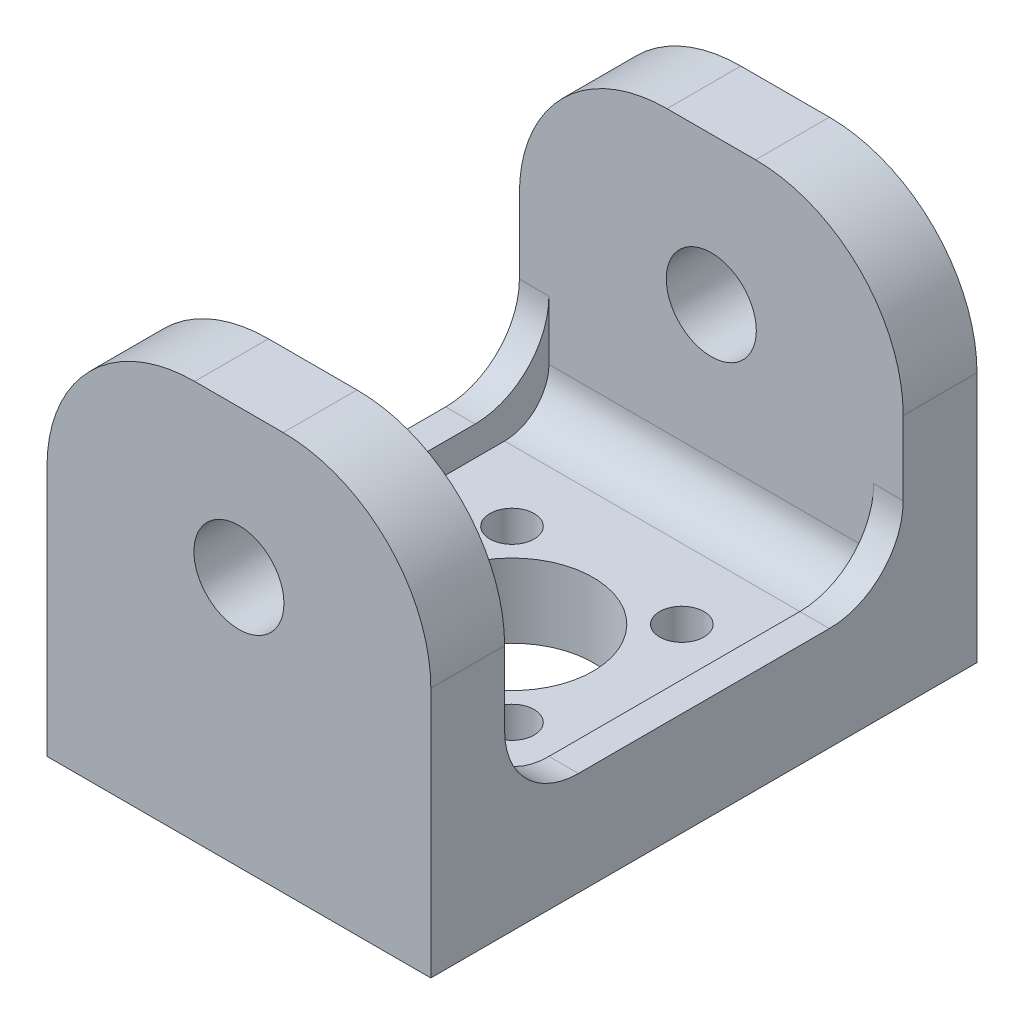
ISO-10303-21;
HEADER;
FILE_DESCRIPTION(('STEP AP214'),'2;1');
FILE_NAME('part.step','',(''),(''),'','','');
FILE_SCHEMA(('AUTOMOTIVE_DESIGN { 1 0 10303 214 1 1 1 1 }'));
ENDSEC;
DATA;
#1=APPLICATION_CONTEXT('core data for automotive mechanical design processes');
#2=APPLICATION_PROTOCOL_DEFINITION('international standard','automotive_design',2000,#1);
#3=PRODUCT_CONTEXT('',#1,'mechanical');
#4=PRODUCT('Part','Part','',(#3));
#5=PRODUCT_RELATED_PRODUCT_CATEGORY('part','',(#4));
#6=PRODUCT_DEFINITION_FORMATION('','',#4);
#7=PRODUCT_DEFINITION_CONTEXT('part definition',#1,'design');
#8=PRODUCT_DEFINITION('design','',#6,#7);
#9=PRODUCT_DEFINITION_SHAPE('','',#8);
#10=(LENGTH_UNIT() NAMED_UNIT(*) SI_UNIT(.MILLI.,.METRE.));
#11=(NAMED_UNIT(*) PLANE_ANGLE_UNIT() SI_UNIT($,.RADIAN.));
#12=(NAMED_UNIT(*) SI_UNIT($,.STERADIAN.) SOLID_ANGLE_UNIT());
#13=UNCERTAINTY_MEASURE_WITH_UNIT(LENGTH_MEASURE(1.E-05),#10,'distance_accuracy_value','');
#14=(GEOMETRIC_REPRESENTATION_CONTEXT(3) GLOBAL_UNCERTAINTY_ASSIGNED_CONTEXT((#13)) GLOBAL_UNIT_ASSIGNED_CONTEXT((#10,
#11,#12)) REPRESENTATION_CONTEXT('',''));
#15=CARTESIAN_POINT('',(0.,0.,0.));
#16=DIRECTION('',(0.,0.,1.));
#17=DIRECTION('',(1.,0.,0.));
#18=AXIS2_PLACEMENT_3D('',#15,#16,#17);
#19=CARTESIAN_POINT('',(0.,5.,0.));
#20=DIRECTION('',(0.,1.,0.));
#21=DIRECTION('',(0.,0.,1.));
#22=AXIS2_PLACEMENT_3D('',#19,#20,#21);
#23=PLANE('',#22);
#24=CARTESIAN_POINT('',(5.75,5.,-5.75000000000033));
#25=DIRECTION('',(0.,1.,0.));
#26=DIRECTION('',(0.,0.,1.));
#27=AXIS2_PLACEMENT_3D('',#24,#25,#26);
#28=CIRCLE('',#27,1.5);
#29=CARTESIAN_POINT('',(5.75,5.,-4.25000000000033));
#30=VERTEX_POINT('',#29);
#31=EDGE_CURVE('E303',#30,#30,#28,.T.);
#32=ORIENTED_EDGE('',*,*,#31,.F.);
#33=EDGE_LOOP('',(#32));
#34=FACE_BOUND('',#33,.T.);
#35=CARTESIAN_POINT('',(0.,5.,0.));
#36=DIRECTION('',(0.,1.,0.));
#37=DIRECTION('',(0.,0.,1.));
#38=AXIS2_PLACEMENT_3D('',#35,#36,#37);
#39=CIRCLE('',#38,5.5);
#40=CARTESIAN_POINT('',(0.,5.,5.5));
#41=VERTEX_POINT('',#40);
#42=EDGE_CURVE('E312',#41,#41,#39,.T.);
#43=ORIENTED_EDGE('',*,*,#42,.F.);
#44=EDGE_LOOP('',(#43));
#45=FACE_BOUND('',#44,.T.);
#46=CARTESIAN_POINT('',(5.75000000000032,5.,5.74999999999967));
#47=DIRECTION('',(0.,1.,0.));
#48=DIRECTION('',(0.,0.,1.));
#49=AXIS2_PLACEMENT_3D('',#46,#47,#48);
#50=CIRCLE('',#49,1.5);
#51=CARTESIAN_POINT('',(5.75000000000032,5.,7.24999999999967));
#52=VERTEX_POINT('',#51);
#53=EDGE_CURVE('E304',#52,#52,#50,.T.);
#54=ORIENTED_EDGE('',*,*,#53,.F.);
#55=EDGE_LOOP('',(#54));
#56=FACE_BOUND('',#55,.T.);
#57=CARTESIAN_POINT('',(-5.74999999999967,5.,5.75));
#58=DIRECTION('',(0.,1.,0.));
#59=DIRECTION('',(0.,0.,1.));
#60=AXIS2_PLACEMENT_3D('',#57,#58,#59);
#61=CIRCLE('',#60,1.5);
#62=CARTESIAN_POINT('',(-5.74999999999967,5.,7.25));
#63=VERTEX_POINT('',#62);
#64=EDGE_CURVE('E289',#63,#63,#61,.T.);
#65=ORIENTED_EDGE('',*,*,#64,.F.);
#66=EDGE_LOOP('',(#65));
#67=FACE_BOUND('',#66,.T.);
#68=CARTESIAN_POINT('',(-5.75,5.,-5.75));
#69=DIRECTION('',(0.,1.,0.));
#70=DIRECTION('',(0.,0.,1.));
#71=AXIS2_PLACEMENT_3D('',#68,#69,#70);
#72=CIRCLE('',#71,1.5);
#73=CARTESIAN_POINT('',(-5.75,5.,-4.25));
#74=VERTEX_POINT('',#73);
#75=EDGE_CURVE('E321',#74,#74,#72,.T.);
#76=ORIENTED_EDGE('',*,*,#75,.F.);
#77=EDGE_LOOP('',(#76));
#78=FACE_BOUND('',#77,.T.);
#79=DIRECTION('',(1.,0.,0.));
#80=VECTOR('',#79,1.);
#81=CARTESIAN_POINT('',(0.,5.,10.5));
#82=LINE('',#81,#80);
#83=CARTESIAN_POINT('',(-11.,5.,10.5));
#84=VERTEX_POINT('',#83);
#85=CARTESIAN_POINT('',(11.,5.,10.5));
#86=VERTEX_POINT('',#85);
#87=EDGE_CURVE('E199',#84,#86,#82,.T.);
#88=ORIENTED_EDGE('',*,*,#87,.T.);
#89=DIRECTION('',(0.,0.,-1.));
#90=VECTOR('',#89,1.);
#91=CARTESIAN_POINT('',(11.,5.,0.));
#92=LINE('',#91,#90);
#93=CARTESIAN_POINT('',(11.,5.,-10.5));
#94=VERTEX_POINT('',#93);
#95=EDGE_CURVE('E187',#86,#94,#92,.T.);
#96=ORIENTED_EDGE('',*,*,#95,.T.);
#97=DIRECTION('',(-1.,0.,0.));
#98=VECTOR('',#97,1.);
#99=CARTESIAN_POINT('',(0.,5.,-10.5));
#100=LINE('',#99,#98);
#101=CARTESIAN_POINT('',(-11.,5.,-10.5));
#102=VERTEX_POINT('',#101);
#103=EDGE_CURVE('E197',#94,#102,#100,.T.);
#104=ORIENTED_EDGE('',*,*,#103,.T.);
#105=DIRECTION('',(0.,0.,1.));
#106=VECTOR('',#105,1.);
#107=CARTESIAN_POINT('',(-11.,5.,0.));
#108=LINE('',#107,#106);
#109=EDGE_CURVE('E274',#102,#84,#108,.T.);
#110=ORIENTED_EDGE('',*,*,#109,.T.);
#111=EDGE_LOOP('',(#88,#96,#104,#110));
#112=FACE_BOUND('',#111,.T.);
#113=ADVANCED_FACE('F37',(#34,#45,#56,#67,#78,#112),#23,.T.);
#114=CARTESIAN_POINT('',(0.,8.,10.5));
#115=DIRECTION('',(1.,0.,0.));
#116=DIRECTION('',(0.,0.,-1.));
#117=AXIS2_PLACEMENT_3D('',#114,#115,#116);
#118=CYLINDRICAL_SURFACE('',#117,3.);
#119=DIRECTION('',(1.,0.,0.));
#120=VECTOR('',#119,1.);
#121=CARTESIAN_POINT('',(-13.,8.,13.5));
#122=LINE('',#121,#120);
#123=CARTESIAN_POINT('',(11.,8.,13.5));
#124=VERTEX_POINT('',#123);
#125=CARTESIAN_POINT('',(-11.,8.,13.5));
#126=VERTEX_POINT('',#125);
#127=EDGE_CURVE('E207',#124,#126,#122,.F.);
#128=ORIENTED_EDGE('',*,*,#127,.F.);
#129=CARTESIAN_POINT('',(11.,8.,10.5));
#130=DIRECTION('',(1.,0.,0.));
#131=DIRECTION('',(0.,0.,-1.));
#132=AXIS2_PLACEMENT_3D('',#129,#130,#131);
#133=CIRCLE('',#132,3.);
#134=EDGE_CURVE('E200',#86,#124,#133,.F.);
#135=ORIENTED_EDGE('',*,*,#134,.F.);
#136=ORIENTED_EDGE('',*,*,#87,.F.);
#137=CARTESIAN_POINT('',(-11.,8.,10.5));
#138=DIRECTION('',(-1.,0.,0.));
#139=DIRECTION('',(0.,0.,1.));
#140=AXIS2_PLACEMENT_3D('',#137,#138,#139);
#141=CIRCLE('',#140,3.);
#142=EDGE_CURVE('E52',#126,#84,#141,.F.);
#143=ORIENTED_EDGE('',*,*,#142,.F.);
#144=EDGE_LOOP('',(#128,#135,#136,#143));
#145=FACE_BOUND('',#144,.T.);
#146=ADVANCED_FACE('F487',(#145),#118,.F.);
#147=CARTESIAN_POINT('',(0.,8.,-10.5));
#148=DIRECTION('',(-1.,0.,0.));
#149=DIRECTION('',(0.,0.,1.));
#150=AXIS2_PLACEMENT_3D('',#147,#148,#149);
#151=CYLINDRICAL_SURFACE('',#150,3.);
#152=CARTESIAN_POINT('',(11.,8.,-10.5));
#153=DIRECTION('',(1.,0.,0.));
#154=DIRECTION('',(0.,0.,-1.));
#155=AXIS2_PLACEMENT_3D('',#152,#153,#154);
#156=CIRCLE('',#155,3.);
#157=CARTESIAN_POINT('',(11.,8.,-13.5));
#158=VERTEX_POINT('',#157);
#159=EDGE_CURVE('E60',#158,#94,#156,.F.);
#160=ORIENTED_EDGE('',*,*,#159,.F.);
#161=DIRECTION('',(-1.,0.,0.));
#162=VECTOR('',#161,1.);
#163=CARTESIAN_POINT('',(-13.,8.,-13.5));
#164=LINE('',#163,#162);
#165=CARTESIAN_POINT('',(-11.,8.,-13.5));
#166=VERTEX_POINT('',#165);
#167=EDGE_CURVE('E215',#166,#158,#164,.F.);
#168=ORIENTED_EDGE('',*,*,#167,.F.);
#169=CARTESIAN_POINT('',(-11.,8.,-10.5));
#170=DIRECTION('',(-1.,0.,0.));
#171=DIRECTION('',(0.,0.,1.));
#172=AXIS2_PLACEMENT_3D('',#169,#170,#171);
#173=CIRCLE('',#172,3.);
#174=EDGE_CURVE('E204',#102,#166,#173,.F.);
#175=ORIENTED_EDGE('',*,*,#174,.F.);
#176=ORIENTED_EDGE('',*,*,#103,.F.);
#177=EDGE_LOOP('',(#160,#168,#175,#176));
#178=FACE_BOUND('',#177,.T.);
#179=ADVANCED_FACE('F203',(#178),#151,.F.);
#180=CARTESIAN_POINT('',(13.,5.,-18.5));
#181=DIRECTION('',(-1.,0.,0.));
#182=DIRECTION('',(0.,0.,1.));
#183=AXIS2_PLACEMENT_3D('',#180,#181,#182);
#184=PLANE('',#183);
#185=DIRECTION('',(0.,0.,-1.));
#186=VECTOR('',#185,1.);
#187=CARTESIAN_POINT('',(13.,7.,-18.5));
#188=LINE('',#187,#186);
#189=CARTESIAN_POINT('',(13.,7.,8.5));
#190=VERTEX_POINT('',#189);
#191=CARTESIAN_POINT('',(13.,7.,-8.5));
#192=VERTEX_POINT('',#191);
#193=EDGE_CURVE('E430',#190,#192,#188,.T.);
#194=ORIENTED_EDGE('',*,*,#193,.F.);
#195=CARTESIAN_POINT('',(13.,12.,8.5));
#196=DIRECTION('',(-1.,0.,0.));
#197=DIRECTION('',(0.,0.,1.));
#198=AXIS2_PLACEMENT_3D('',#195,#196,#197);
#199=CIRCLE('',#198,5.);
#200=CARTESIAN_POINT('',(13.,12.,13.5));
#201=VERTEX_POINT('',#200);
#202=EDGE_CURVE('E254',#190,#201,#199,.T.);
#203=ORIENTED_EDGE('',*,*,#202,.T.);
#204=DIRECTION('',(0.,-1.,0.));
#205=VECTOR('',#204,1.);
#206=CARTESIAN_POINT('',(13.,27.,13.5));
#207=LINE('',#206,#205);
#208=CARTESIAN_POINT('',(13.,17.,13.5));
#209=VERTEX_POINT('',#208);
#210=EDGE_CURVE('E414',#209,#201,#207,.T.);
#211=ORIENTED_EDGE('',*,*,#210,.F.);
#212=DIRECTION('',(0.,0.,-1.));
#213=VECTOR('',#212,1.);
#214=CARTESIAN_POINT('',(13.,17.,18.5));
#215=LINE('',#214,#213);
#216=CARTESIAN_POINT('',(13.,17.,18.5));
#217=VERTEX_POINT('',#216);
#218=EDGE_CURVE('E205',#209,#217,#215,.F.);
#219=ORIENTED_EDGE('',*,*,#218,.T.);
#220=DIRECTION('',(0.,-1.,0.));
#221=VECTOR('',#220,1.);
#222=CARTESIAN_POINT('',(13.,5.,18.5));
#223=LINE('',#222,#221);
#224=CARTESIAN_POINT('',(13.,0.,18.5));
#225=VERTEX_POINT('',#224);
#226=EDGE_CURVE('E337',#217,#225,#223,.T.);
#227=ORIENTED_EDGE('',*,*,#226,.T.);
#228=DIRECTION('',(0.,0.,-1.));
#229=VECTOR('',#228,1.);
#230=CARTESIAN_POINT('',(13.,0.,-18.5));
#231=LINE('',#230,#229);
#232=CARTESIAN_POINT('',(13.,0.,-18.5));
#233=VERTEX_POINT('',#232);
#234=EDGE_CURVE('E324',#225,#233,#231,.T.);
#235=ORIENTED_EDGE('',*,*,#234,.T.);
#236=DIRECTION('',(0.,-1.,0.));
#237=VECTOR('',#236,1.);
#238=CARTESIAN_POINT('',(13.,5.,-18.5));
#239=LINE('',#238,#237);
#240=CARTESIAN_POINT('',(13.,17.,-18.5));
#241=VERTEX_POINT('',#240);
#242=EDGE_CURVE('E344',#241,#233,#239,.T.);
#243=ORIENTED_EDGE('',*,*,#242,.F.);
#244=DIRECTION('',(0.,0.,-1.));
#245=VECTOR('',#244,1.);
#246=CARTESIAN_POINT('',(13.,17.,-13.5));
#247=LINE('',#246,#245);
#248=CARTESIAN_POINT('',(13.,17.,-13.5));
#249=VERTEX_POINT('',#248);
#250=EDGE_CURVE('E209',#241,#249,#247,.F.);
#251=ORIENTED_EDGE('',*,*,#250,.T.);
#252=DIRECTION('',(0.,-1.,0.));
#253=VECTOR('',#252,1.);
#254=CARTESIAN_POINT('',(13.,27.,-13.5));
#255=LINE('',#254,#253);
#256=CARTESIAN_POINT('',(13.,12.,-13.5));
#257=VERTEX_POINT('',#256);
#258=EDGE_CURVE('E290',#249,#257,#255,.T.);
#259=ORIENTED_EDGE('',*,*,#258,.T.);
#260=CARTESIAN_POINT('',(13.,12.,-8.5));
#261=DIRECTION('',(-1.,0.,0.));
#262=DIRECTION('',(0.,0.,1.));
#263=AXIS2_PLACEMENT_3D('',#260,#261,#262);
#264=CIRCLE('',#263,5.);
#265=EDGE_CURVE('E248',#257,#192,#264,.T.);
#266=ORIENTED_EDGE('',*,*,#265,.T.);
#267=EDGE_LOOP('',(#194,#203,#211,#219,#227,#235,#243,#251,#259,#266));
#268=FACE_BOUND('',#267,.T.);
#269=ADVANCED_FACE('F386',(#268),#184,.F.);
#270=CARTESIAN_POINT('',(-13.,5.,-18.5));
#271=DIRECTION('',(0.,0.,1.));
#272=DIRECTION('',(1.,0.,0.));
#273=AXIS2_PLACEMENT_3D('',#270,#271,#272);
#274=PLANE('',#273);
#275=DIRECTION('',(-1.,0.,0.));
#276=VECTOR('',#275,1.);
#277=CARTESIAN_POINT('',(-13.,0.,-18.5));
#278=LINE('',#277,#276);
#279=CARTESIAN_POINT('',(-13.,0.,-18.5));
#280=VERTEX_POINT('',#279);
#281=EDGE_CURVE('E329',#233,#280,#278,.T.);
#282=ORIENTED_EDGE('',*,*,#281,.T.);
#283=DIRECTION('',(0.,-1.,0.));
#284=VECTOR('',#283,1.);
#285=CARTESIAN_POINT('',(-13.,5.,-18.5));
#286=LINE('',#285,#284);
#287=CARTESIAN_POINT('',(-13.,17.,-18.5));
#288=VERTEX_POINT('',#287);
#289=EDGE_CURVE('E341',#288,#280,#286,.T.);
#290=ORIENTED_EDGE('',*,*,#289,.F.);
#291=CARTESIAN_POINT('',(-3.,17.,-18.5));
#292=DIRECTION('',(0.,0.,1.));
#293=DIRECTION('',(1.,0.,0.));
#294=AXIS2_PLACEMENT_3D('',#291,#292,#293);
#295=CIRCLE('',#294,10.);
#296=CARTESIAN_POINT('',(-3.,27.,-18.5));
#297=VERTEX_POINT('',#296);
#298=EDGE_CURVE('E366',#288,#297,#295,.F.);
#299=ORIENTED_EDGE('',*,*,#298,.T.);
#300=DIRECTION('',(-1.,0.,0.));
#301=VECTOR('',#300,1.);
#302=CARTESIAN_POINT('',(-13.,27.,-18.5));
#303=LINE('',#302,#301);
#304=CARTESIAN_POINT('',(3.,27.,-18.5));
#305=VERTEX_POINT('',#304);
#306=EDGE_CURVE('E296',#305,#297,#303,.T.);
#307=ORIENTED_EDGE('',*,*,#306,.F.);
#308=CARTESIAN_POINT('',(3.,17.,-18.5));
#309=DIRECTION('',(0.,0.,1.));
#310=DIRECTION('',(1.,0.,0.));
#311=AXIS2_PLACEMENT_3D('',#308,#309,#310);
#312=CIRCLE('',#311,10.);
#313=EDGE_CURVE('E364',#305,#241,#312,.F.);
#314=ORIENTED_EDGE('',*,*,#313,.T.);
#315=ORIENTED_EDGE('',*,*,#242,.T.);
#316=EDGE_LOOP('',(#282,#290,#299,#307,#314,#315));
#317=FACE_BOUND('',#316,.T.);
#318=CARTESIAN_POINT('',(0.,17.,-18.5));
#319=DIRECTION('',(0.,0.,1.));
#320=DIRECTION('',(1.,0.,0.));
#321=AXIS2_PLACEMENT_3D('',#318,#319,#320);
#322=CIRCLE('',#321,3.05);
#323=CARTESIAN_POINT('',(3.05,17.,-18.5));
#324=VERTEX_POINT('',#323);
#325=EDGE_CURVE('E351',#324,#324,#322,.T.);
#326=ORIENTED_EDGE('',*,*,#325,.T.);
#327=EDGE_LOOP('',(#326));
#328=FACE_BOUND('',#327,.T.);
#329=ADVANCED_FACE('F400',(#317,#328),#274,.F.);
#330=CARTESIAN_POINT('',(-13.,5.,-18.5));
#331=DIRECTION('',(1.,0.,0.));
#332=DIRECTION('',(0.,0.,-1.));
#333=AXIS2_PLACEMENT_3D('',#330,#331,#332);
#334=PLANE('',#333);
#335=DIRECTION('',(0.,-1.,0.));
#336=VECTOR('',#335,1.);
#337=CARTESIAN_POINT('',(-13.,27.,13.5));
#338=LINE('',#337,#336);
#339=CARTESIAN_POINT('',(-13.,17.,13.5));
#340=VERTEX_POINT('',#339);
#341=CARTESIAN_POINT('',(-13.,12.,13.5));
#342=VERTEX_POINT('',#341);
#343=EDGE_CURVE('E412',#340,#342,#338,.T.);
#344=ORIENTED_EDGE('',*,*,#343,.T.);
#345=CARTESIAN_POINT('',(-13.,12.,8.5));
#346=DIRECTION('',(1.,0.,0.));
#347=DIRECTION('',(0.,0.,-1.));
#348=AXIS2_PLACEMENT_3D('',#345,#346,#347);
#349=CIRCLE('',#348,5.);
#350=CARTESIAN_POINT('',(-13.,7.,8.5));
#351=VERTEX_POINT('',#350);
#352=EDGE_CURVE('E256',#342,#351,#349,.T.);
#353=ORIENTED_EDGE('',*,*,#352,.T.);
#354=DIRECTION('',(0.,0.,1.));
#355=VECTOR('',#354,1.);
#356=CARTESIAN_POINT('',(-13.,7.,-18.5));
#357=LINE('',#356,#355);
#358=CARTESIAN_POINT('',(-13.,7.,-8.5));
#359=VERTEX_POINT('',#358);
#360=EDGE_CURVE('E275',#359,#351,#357,.T.);
#361=ORIENTED_EDGE('',*,*,#360,.F.);
#362=CARTESIAN_POINT('',(-13.,12.,-8.5));
#363=DIRECTION('',(1.,0.,0.));
#364=DIRECTION('',(0.,0.,-1.));
#365=AXIS2_PLACEMENT_3D('',#362,#363,#364);
#366=CIRCLE('',#365,5.);
#367=CARTESIAN_POINT('',(-13.,12.,-13.5));
#368=VERTEX_POINT('',#367);
#369=EDGE_CURVE('E11',#359,#368,#366,.T.);
#370=ORIENTED_EDGE('',*,*,#369,.T.);
#371=DIRECTION('',(0.,-1.,0.));
#372=VECTOR('',#371,1.);
#373=CARTESIAN_POINT('',(-13.,27.,-13.5));
#374=LINE('',#373,#372);
#375=CARTESIAN_POINT('',(-13.,17.,-13.5));
#376=VERTEX_POINT('',#375);
#377=EDGE_CURVE('E283',#376,#368,#374,.T.);
#378=ORIENTED_EDGE('',*,*,#377,.F.);
#379=DIRECTION('',(0.,0.,1.));
#380=VECTOR('',#379,1.);
#381=CARTESIAN_POINT('',(-13.,17.,-18.5));
#382=LINE('',#381,#380);
#383=EDGE_CURVE('E362',#376,#288,#382,.F.);
#384=ORIENTED_EDGE('',*,*,#383,.T.);
#385=ORIENTED_EDGE('',*,*,#289,.T.);
#386=DIRECTION('',(0.,0.,1.));
#387=VECTOR('',#386,1.);
#388=CARTESIAN_POINT('',(-13.,0.,-18.5));
#389=LINE('',#388,#387);
#390=CARTESIAN_POINT('',(-13.,0.,18.5));
#391=VERTEX_POINT('',#390);
#392=EDGE_CURVE('E331',#280,#391,#389,.T.);
#393=ORIENTED_EDGE('',*,*,#392,.T.);
#394=DIRECTION('',(0.,-1.,0.));
#395=VECTOR('',#394,1.);
#396=CARTESIAN_POINT('',(-13.,5.,18.5));
#397=LINE('',#396,#395);
#398=CARTESIAN_POINT('',(-13.,17.,18.5));
#399=VERTEX_POINT('',#398);
#400=EDGE_CURVE('E339',#399,#391,#397,.T.);
#401=ORIENTED_EDGE('',*,*,#400,.F.);
#402=DIRECTION('',(0.,0.,1.));
#403=VECTOR('',#402,1.);
#404=CARTESIAN_POINT('',(-13.,17.,13.5));
#405=LINE('',#404,#403);
#406=EDGE_CURVE('E360',#399,#340,#405,.F.);
#407=ORIENTED_EDGE('',*,*,#406,.T.);
#408=EDGE_LOOP('',(#344,#353,#361,#370,#378,#384,#385,#393,#401,#407));
#409=FACE_BOUND('',#408,.T.);
#410=ADVANCED_FACE('F282',(#409),#334,.F.);
#411=CARTESIAN_POINT('',(-13.,5.,18.5));
#412=DIRECTION('',(0.,0.,-1.));
#413=DIRECTION('',(-1.,0.,0.));
#414=AXIS2_PLACEMENT_3D('',#411,#412,#413);
#415=PLANE('',#414);
#416=DIRECTION('',(1.,0.,0.));
#417=VECTOR('',#416,1.);
#418=CARTESIAN_POINT('',(-13.,0.,18.5));
#419=LINE('',#418,#417);
#420=EDGE_CURVE('E334',#391,#225,#419,.T.);
#421=ORIENTED_EDGE('',*,*,#420,.T.);
#422=ORIENTED_EDGE('',*,*,#226,.F.);
#423=CARTESIAN_POINT('',(3.,17.,18.5));
#424=DIRECTION('',(0.,0.,-1.));
#425=DIRECTION('',(-1.,0.,0.));
#426=AXIS2_PLACEMENT_3D('',#423,#424,#425);
#427=CIRCLE('',#426,10.);
#428=CARTESIAN_POINT('',(3.,27.,18.5));
#429=VERTEX_POINT('',#428);
#430=EDGE_CURVE('E374',#217,#429,#427,.F.);
#431=ORIENTED_EDGE('',*,*,#430,.T.);
#432=DIRECTION('',(1.,0.,0.));
#433=VECTOR('',#432,1.);
#434=CARTESIAN_POINT('',(-13.,27.,18.5));
#435=LINE('',#434,#433);
#436=CARTESIAN_POINT('',(-3.,27.,18.5));
#437=VERTEX_POINT('',#436);
#438=EDGE_CURVE('E404',#437,#429,#435,.T.);
#439=ORIENTED_EDGE('',*,*,#438,.F.);
#440=CARTESIAN_POINT('',(-3.,17.,18.5));
#441=DIRECTION('',(0.,0.,-1.));
#442=DIRECTION('',(-1.,0.,0.));
#443=AXIS2_PLACEMENT_3D('',#440,#441,#442);
#444=CIRCLE('',#443,10.);
#445=EDGE_CURVE('E376',#437,#399,#444,.F.);
#446=ORIENTED_EDGE('',*,*,#445,.T.);
#447=ORIENTED_EDGE('',*,*,#400,.T.);
#448=EDGE_LOOP('',(#421,#422,#431,#439,#446,#447));
#449=FACE_BOUND('',#448,.T.);
#450=CARTESIAN_POINT('',(0.,17.,18.5));
#451=DIRECTION('',(0.,0.,1.));
#452=DIRECTION('',(1.,0.,0.));
#453=AXIS2_PLACEMENT_3D('',#450,#451,#452);
#454=CIRCLE('',#453,3.05);
#455=CARTESIAN_POINT('',(3.05,17.,18.5));
#456=VERTEX_POINT('',#455);
#457=EDGE_CURVE('E421',#456,#456,#454,.T.);
#458=ORIENTED_EDGE('',*,*,#457,.F.);
#459=EDGE_LOOP('',(#458));
#460=FACE_BOUND('',#459,.T.);
#461=ADVANCED_FACE('F459',(#449,#460),#415,.F.);
#462=CARTESIAN_POINT('',(0.,0.,0.));
#463=DIRECTION('',(0.,1.,0.));
#464=DIRECTION('',(0.,0.,1.));
#465=AXIS2_PLACEMENT_3D('',#462,#463,#464);
#466=PLANE('',#465);
#467=ORIENTED_EDGE('',*,*,#234,.F.);
#468=ORIENTED_EDGE('',*,*,#420,.F.);
#469=ORIENTED_EDGE('',*,*,#392,.F.);
#470=ORIENTED_EDGE('',*,*,#281,.F.);
#471=EDGE_LOOP('',(#467,#468,#469,#470));
#472=FACE_BOUND('',#471,.T.);
#473=CARTESIAN_POINT('',(5.75,0.,-5.75000000000033));
#474=DIRECTION('',(0.,1.,0.));
#475=DIRECTION('',(0.,0.,1.));
#476=AXIS2_PLACEMENT_3D('',#473,#474,#475);
#477=CIRCLE('',#476,1.5);
#478=CARTESIAN_POINT('',(5.75,0.,-4.25000000000033));
#479=VERTEX_POINT('',#478);
#480=EDGE_CURVE('E309',#479,#479,#477,.T.);
#481=ORIENTED_EDGE('',*,*,#480,.T.);
#482=EDGE_LOOP('',(#481));
#483=FACE_BOUND('',#482,.T.);
#484=CARTESIAN_POINT('',(0.,0.,0.));
#485=DIRECTION('',(0.,1.,0.));
#486=DIRECTION('',(0.,0.,1.));
#487=AXIS2_PLACEMENT_3D('',#484,#485,#486);
#488=CIRCLE('',#487,5.5);
#489=CARTESIAN_POINT('',(0.,0.,5.5));
#490=VERTEX_POINT('',#489);
#491=EDGE_CURVE('E315',#490,#490,#488,.T.);
#492=ORIENTED_EDGE('',*,*,#491,.T.);
#493=EDGE_LOOP('',(#492));
#494=FACE_BOUND('',#493,.T.);
#495=CARTESIAN_POINT('',(5.75000000000032,0.,5.74999999999967));
#496=DIRECTION('',(0.,1.,0.));
#497=DIRECTION('',(0.,0.,1.));
#498=AXIS2_PLACEMENT_3D('',#495,#496,#497);
#499=CIRCLE('',#498,1.5);
#500=CARTESIAN_POINT('',(5.75000000000032,0.,7.24999999999967));
#501=VERTEX_POINT('',#500);
#502=EDGE_CURVE('E300',#501,#501,#499,.T.);
#503=ORIENTED_EDGE('',*,*,#502,.T.);
#504=EDGE_LOOP('',(#503));
#505=FACE_BOUND('',#504,.T.);
#506=CARTESIAN_POINT('',(-5.74999999999967,0.,5.75));
#507=DIRECTION('',(0.,1.,0.));
#508=DIRECTION('',(0.,0.,1.));
#509=AXIS2_PLACEMENT_3D('',#506,#507,#508);
#510=CIRCLE('',#509,1.5);
#511=CARTESIAN_POINT('',(-5.74999999999967,0.,7.25));
#512=VERTEX_POINT('',#511);
#513=EDGE_CURVE('E293',#512,#512,#510,.T.);
#514=ORIENTED_EDGE('',*,*,#513,.T.);
#515=EDGE_LOOP('',(#514));
#516=FACE_BOUND('',#515,.T.);
#517=CARTESIAN_POINT('',(-5.75,0.,-5.75));
#518=DIRECTION('',(0.,1.,0.));
#519=DIRECTION('',(0.,0.,1.));
#520=AXIS2_PLACEMENT_3D('',#517,#518,#519);
#521=CIRCLE('',#520,1.5);
#522=CARTESIAN_POINT('',(-5.75,0.,-4.25));
#523=VERTEX_POINT('',#522);
#524=EDGE_CURVE('E318',#523,#523,#521,.T.);
#525=ORIENTED_EDGE('',*,*,#524,.T.);
#526=EDGE_LOOP('',(#525));
#527=FACE_BOUND('',#526,.T.);
#528=ADVANCED_FACE('F468',(#472,#483,#494,#505,#516,#527),#466,.F.);
#529=CARTESIAN_POINT('',(-5.75,5.,-5.75));
#530=DIRECTION('',(0.,-1.,0.));
#531=DIRECTION('',(0.,0.,-1.));
#532=AXIS2_PLACEMENT_3D('',#529,#530,#531);
#533=CYLINDRICAL_SURFACE('',#532,1.5);
#534=ORIENTED_EDGE('',*,*,#75,.T.);
#535=EDGE_LOOP('',(#534));
#536=FACE_BOUND('',#535,.T.);
#537=ORIENTED_EDGE('',*,*,#524,.F.);
#538=EDGE_LOOP('',(#537));
#539=FACE_BOUND('',#538,.T.);
#540=ADVANCED_FACE('F498',(#536,#539),#533,.F.);
#541=CARTESIAN_POINT('',(-5.74999999999967,5.,5.75));
#542=DIRECTION('',(0.,-1.,0.));
#543=DIRECTION('',(0.,0.,-1.));
#544=AXIS2_PLACEMENT_3D('',#541,#542,#543);
#545=CYLINDRICAL_SURFACE('',#544,1.5);
#546=ORIENTED_EDGE('',*,*,#64,.T.);
#547=EDGE_LOOP('',(#546));
#548=FACE_BOUND('',#547,.T.);
#549=ORIENTED_EDGE('',*,*,#513,.F.);
#550=EDGE_LOOP('',(#549));
#551=FACE_BOUND('',#550,.T.);
#552=ADVANCED_FACE('F755',(#548,#551),#545,.F.);
#553=CARTESIAN_POINT('',(5.75000000000032,5.,5.74999999999967));
#554=DIRECTION('',(0.,-1.,0.));
#555=DIRECTION('',(0.,0.,-1.));
#556=AXIS2_PLACEMENT_3D('',#553,#554,#555);
#557=CYLINDRICAL_SURFACE('',#556,1.5);
#558=ORIENTED_EDGE('',*,*,#53,.T.);
#559=EDGE_LOOP('',(#558));
#560=FACE_BOUND('',#559,.T.);
#561=ORIENTED_EDGE('',*,*,#502,.F.);
#562=EDGE_LOOP('',(#561));
#563=FACE_BOUND('',#562,.T.);
#564=ADVANCED_FACE('F745',(#560,#563),#557,.F.);
#565=CARTESIAN_POINT('',(0.,5.,0.));
#566=DIRECTION('',(0.,-1.,0.));
#567=DIRECTION('',(0.,0.,-1.));
#568=AXIS2_PLACEMENT_3D('',#565,#566,#567);
#569=CYLINDRICAL_SURFACE('',#568,5.5);
#570=ORIENTED_EDGE('',*,*,#42,.T.);
#571=EDGE_LOOP('',(#570));
#572=FACE_BOUND('',#571,.T.);
#573=ORIENTED_EDGE('',*,*,#491,.F.);
#574=EDGE_LOOP('',(#573));
#575=FACE_BOUND('',#574,.T.);
#576=ADVANCED_FACE('F733',(#572,#575),#569,.F.);
#577=CARTESIAN_POINT('',(5.75,5.,-5.75000000000033));
#578=DIRECTION('',(0.,-1.,0.));
#579=DIRECTION('',(0.,0.,-1.));
#580=AXIS2_PLACEMENT_3D('',#577,#578,#579);
#581=CYLINDRICAL_SURFACE('',#580,1.5);
#582=ORIENTED_EDGE('',*,*,#31,.T.);
#583=EDGE_LOOP('',(#582));
#584=FACE_BOUND('',#583,.T.);
#585=ORIENTED_EDGE('',*,*,#480,.F.);
#586=EDGE_LOOP('',(#585));
#587=FACE_BOUND('',#586,.T.);
#588=ADVANCED_FACE('F612',(#584,#587),#581,.F.);
#589=CARTESIAN_POINT('',(-13.,27.,-13.5));
#590=DIRECTION('',(0.,0.,-1.));
#591=DIRECTION('',(-1.,0.,0.));
#592=AXIS2_PLACEMENT_3D('',#589,#590,#591);
#593=PLANE('',#592);
#594=CARTESIAN_POINT('',(0.,17.,-13.5));
#595=DIRECTION('',(0.,0.,-1.));
#596=DIRECTION('',(-1.,0.,0.));
#597=AXIS2_PLACEMENT_3D('',#594,#595,#596);
#598=CIRCLE('',#597,3.05);
#599=CARTESIAN_POINT('',(-3.05,17.,-13.5));
#600=VERTEX_POINT('',#599);
#601=EDGE_CURVE('E350',#600,#600,#598,.T.);
#602=ORIENTED_EDGE('',*,*,#601,.T.);
#603=EDGE_LOOP('',(#602));
#604=FACE_BOUND('',#603,.T.);
#605=DIRECTION('',(0.,1.,0.));
#606=VECTOR('',#605,1.);
#607=CARTESIAN_POINT('',(11.,7.,-13.5));
#608=LINE('',#607,#606);
#609=CARTESIAN_POINT('',(11.,12.,-13.5));
#610=VERTEX_POINT('',#609);
#611=EDGE_CURVE('E190',#158,#610,#608,.T.);
#612=ORIENTED_EDGE('',*,*,#611,.T.);
#613=DIRECTION('',(1.,0.,0.));
#614=VECTOR('',#613,1.);
#615=CARTESIAN_POINT('',(-13.,12.,-13.5));
#616=LINE('',#615,#614);
#617=EDGE_CURVE('E225',#610,#257,#616,.T.);
#618=ORIENTED_EDGE('',*,*,#617,.T.);
#619=ORIENTED_EDGE('',*,*,#258,.F.);
#620=CARTESIAN_POINT('',(3.,17.,-13.5));
#621=DIRECTION('',(0.,0.,-1.));
#622=DIRECTION('',(-1.,0.,0.));
#623=AXIS2_PLACEMENT_3D('',#620,#621,#622);
#624=CIRCLE('',#623,10.);
#625=CARTESIAN_POINT('',(3.,27.,-13.5));
#626=VERTEX_POINT('',#625);
#627=EDGE_CURVE('E357',#249,#626,#624,.F.);
#628=ORIENTED_EDGE('',*,*,#627,.T.);
#629=DIRECTION('',(1.,0.,0.));
#630=VECTOR('',#629,1.);
#631=CARTESIAN_POINT('',(-13.,27.,-13.5));
#632=LINE('',#631,#630);
#633=CARTESIAN_POINT('',(-3.,27.,-13.5));
#634=VERTEX_POINT('',#633);
#635=EDGE_CURVE('E398',#634,#626,#632,.T.);
#636=ORIENTED_EDGE('',*,*,#635,.F.);
#637=CARTESIAN_POINT('',(-3.,17.,-13.5));
#638=DIRECTION('',(0.,0.,-1.));
#639=DIRECTION('',(-1.,0.,0.));
#640=AXIS2_PLACEMENT_3D('',#637,#638,#639);
#641=CIRCLE('',#640,10.);
#642=EDGE_CURVE('E288',#634,#376,#641,.F.);
#643=ORIENTED_EDGE('',*,*,#642,.T.);
#644=ORIENTED_EDGE('',*,*,#377,.T.);
#645=DIRECTION('',(1.,0.,0.));
#646=VECTOR('',#645,1.);
#647=CARTESIAN_POINT('',(-13.,12.,-13.5));
#648=LINE('',#647,#646);
#649=CARTESIAN_POINT('',(-11.,12.,-13.5));
#650=VERTEX_POINT('',#649);
#651=EDGE_CURVE('E221',#368,#650,#648,.T.);
#652=ORIENTED_EDGE('',*,*,#651,.T.);
#653=DIRECTION('',(0.,-1.,0.));
#654=VECTOR('',#653,1.);
#655=CARTESIAN_POINT('',(-11.,7.,-13.5));
#656=LINE('',#655,#654);
#657=EDGE_CURVE('E218',#650,#166,#656,.T.);
#658=ORIENTED_EDGE('',*,*,#657,.T.);
#659=ORIENTED_EDGE('',*,*,#167,.T.);
#660=EDGE_LOOP('',(#612,#618,#619,#628,#636,#643,#644,#652,#658,#659));
#661=FACE_BOUND('',#660,.T.);
#662=ADVANCED_FACE('F286',(#604,#661),#593,.F.);
#663=CARTESIAN_POINT('',(0.,27.,0.));
#664=DIRECTION('',(0.,1.,0.));
#665=DIRECTION('',(0.,0.,1.));
#666=AXIS2_PLACEMENT_3D('',#663,#664,#665);
#667=PLANE('',#666);
#668=ORIENTED_EDGE('',*,*,#306,.T.);
#669=DIRECTION('',(0.,0.,1.));
#670=VECTOR('',#669,1.);
#671=CARTESIAN_POINT('',(-3.,27.,-13.5));
#672=LINE('',#671,#670);
#673=EDGE_CURVE('E354',#297,#634,#672,.T.);
#674=ORIENTED_EDGE('',*,*,#673,.T.);
#675=ORIENTED_EDGE('',*,*,#635,.T.);
#676=DIRECTION('',(0.,0.,-1.));
#677=VECTOR('',#676,1.);
#678=CARTESIAN_POINT('',(3.,27.,-18.5));
#679=LINE('',#678,#677);
#680=EDGE_CURVE('E346',#626,#305,#679,.T.);
#681=ORIENTED_EDGE('',*,*,#680,.T.);
#682=EDGE_LOOP('',(#668,#674,#675,#681));
#683=FACE_BOUND('',#682,.T.);
#684=ADVANCED_FACE('F396',(#683),#667,.T.);
#685=CARTESIAN_POINT('',(-13.,27.,13.5));
#686=DIRECTION('',(0.,0.,1.));
#687=DIRECTION('',(1.,0.,0.));
#688=AXIS2_PLACEMENT_3D('',#685,#686,#687);
#689=PLANE('',#688);
#690=CARTESIAN_POINT('',(0.,17.,13.5));
#691=DIRECTION('',(0.,0.,1.));
#692=DIRECTION('',(1.,0.,0.));
#693=AXIS2_PLACEMENT_3D('',#690,#691,#692);
#694=CIRCLE('',#693,3.05);
#695=CARTESIAN_POINT('',(3.05,17.,13.5));
#696=VERTEX_POINT('',#695);
#697=EDGE_CURVE('E347',#696,#696,#694,.T.);
#698=ORIENTED_EDGE('',*,*,#697,.T.);
#699=EDGE_LOOP('',(#698));
#700=FACE_BOUND('',#699,.T.);
#701=ORIENTED_EDGE('',*,*,#210,.T.);
#702=DIRECTION('',(-1.,0.,0.));
#703=VECTOR('',#702,1.);
#704=CARTESIAN_POINT('',(-13.,12.,13.5));
#705=LINE('',#704,#703);
#706=CARTESIAN_POINT('',(11.,12.,13.5));
#707=VERTEX_POINT('',#706);
#708=EDGE_CURVE('E241',#201,#707,#705,.T.);
#709=ORIENTED_EDGE('',*,*,#708,.T.);
#710=DIRECTION('',(0.,-1.,0.));
#711=VECTOR('',#710,1.);
#712=CARTESIAN_POINT('',(11.,7.,13.5));
#713=LINE('',#712,#711);
#714=EDGE_CURVE('E238',#707,#124,#713,.T.);
#715=ORIENTED_EDGE('',*,*,#714,.T.);
#716=ORIENTED_EDGE('',*,*,#127,.T.);
#717=DIRECTION('',(0.,1.,0.));
#718=VECTOR('',#717,1.);
#719=CARTESIAN_POINT('',(-11.,7.,13.5));
#720=LINE('',#719,#718);
#721=CARTESIAN_POINT('',(-11.,12.,13.5));
#722=VERTEX_POINT('',#721);
#723=EDGE_CURVE('E232',#126,#722,#720,.T.);
#724=ORIENTED_EDGE('',*,*,#723,.T.);
#725=DIRECTION('',(-1.,0.,0.));
#726=VECTOR('',#725,1.);
#727=CARTESIAN_POINT('',(-13.,12.,13.5));
#728=LINE('',#727,#726);
#729=EDGE_CURVE('E235',#722,#342,#728,.T.);
#730=ORIENTED_EDGE('',*,*,#729,.T.);
#731=ORIENTED_EDGE('',*,*,#343,.F.);
#732=CARTESIAN_POINT('',(-3.,17.,13.5));
#733=DIRECTION('',(0.,0.,1.));
#734=DIRECTION('',(1.,0.,0.));
#735=AXIS2_PLACEMENT_3D('',#732,#733,#734);
#736=CIRCLE('',#735,10.);
#737=CARTESIAN_POINT('',(-3.,27.,13.5));
#738=VERTEX_POINT('',#737);
#739=EDGE_CURVE('E380',#340,#738,#736,.F.);
#740=ORIENTED_EDGE('',*,*,#739,.T.);
#741=DIRECTION('',(-1.,0.,0.));
#742=VECTOR('',#741,1.);
#743=CARTESIAN_POINT('',(-13.,27.,13.5));
#744=LINE('',#743,#742);
#745=CARTESIAN_POINT('',(3.,27.,13.5));
#746=VERTEX_POINT('',#745);
#747=EDGE_CURVE('E409',#746,#738,#744,.T.);
#748=ORIENTED_EDGE('',*,*,#747,.F.);
#749=CARTESIAN_POINT('',(3.,17.,13.5));
#750=DIRECTION('',(0.,0.,1.));
#751=DIRECTION('',(1.,0.,0.));
#752=AXIS2_PLACEMENT_3D('',#749,#750,#751);
#753=CIRCLE('',#752,10.);
#754=EDGE_CURVE('E378',#746,#209,#753,.F.);
#755=ORIENTED_EDGE('',*,*,#754,.T.);
#756=EDGE_LOOP('',(#701,#709,#715,#716,#724,#730,#731,#740,#748,#755));
#757=FACE_BOUND('',#756,.T.);
#758=ADVANCED_FACE('F448',(#700,#757),#689,.F.);
#759=CARTESIAN_POINT('',(0.,27.,0.));
#760=DIRECTION('',(0.,1.,0.));
#761=DIRECTION('',(0.,0.,1.));
#762=AXIS2_PLACEMENT_3D('',#759,#760,#761);
#763=PLANE('',#762);
#764=ORIENTED_EDGE('',*,*,#747,.T.);
#765=DIRECTION('',(0.,0.,1.));
#766=VECTOR('',#765,1.);
#767=CARTESIAN_POINT('',(-3.,27.,18.5));
#768=LINE('',#767,#766);
#769=EDGE_CURVE('E371',#738,#437,#768,.T.);
#770=ORIENTED_EDGE('',*,*,#769,.T.);
#771=ORIENTED_EDGE('',*,*,#438,.T.);
#772=DIRECTION('',(0.,0.,-1.));
#773=VECTOR('',#772,1.);
#774=CARTESIAN_POINT('',(3.,27.,13.5));
#775=LINE('',#774,#773);
#776=EDGE_CURVE('E368',#429,#746,#775,.T.);
#777=ORIENTED_EDGE('',*,*,#776,.T.);
#778=EDGE_LOOP('',(#764,#770,#771,#777));
#779=FACE_BOUND('',#778,.T.);
#780=ADVANCED_FACE('F455',(#779),#763,.T.);
#781=CARTESIAN_POINT('',(0.,17.,-18.5));
#782=DIRECTION('',(0.,0.,1.));
#783=DIRECTION('',(1.,0.,0.));
#784=AXIS2_PLACEMENT_3D('',#781,#782,#783);
#785=CYLINDRICAL_SURFACE('',#784,3.05);
#786=ORIENTED_EDGE('',*,*,#457,.T.);
#787=EDGE_LOOP('',(#786));
#788=FACE_BOUND('',#787,.T.);
#789=ORIENTED_EDGE('',*,*,#697,.F.);
#790=EDGE_LOOP('',(#789));
#791=FACE_BOUND('',#790,.T.);
#792=ADVANCED_FACE('F482',(#788,#791),#785,.F.);
#793=ORIENTED_EDGE('',*,*,#325,.F.);
#794=EDGE_LOOP('',(#793));
#795=FACE_BOUND('',#794,.T.);
#796=ORIENTED_EDGE('',*,*,#601,.F.);
#797=EDGE_LOOP('',(#796));
#798=FACE_BOUND('',#797,.T.);
#799=ADVANCED_FACE('F474',(#795,#798),#785,.F.);
#800=CARTESIAN_POINT('',(-3.,17.,0.));
#801=DIRECTION('',(0.,0.,-1.));
#802=DIRECTION('',(-1.,0.,0.));
#803=AXIS2_PLACEMENT_3D('',#800,#801,#802);
#804=CYLINDRICAL_SURFACE('',#803,10.);
#805=ORIENTED_EDGE('',*,*,#298,.F.);
#806=ORIENTED_EDGE('',*,*,#383,.F.);
#807=ORIENTED_EDGE('',*,*,#642,.F.);
#808=ORIENTED_EDGE('',*,*,#673,.F.);
#809=EDGE_LOOP('',(#805,#806,#807,#808));
#810=FACE_BOUND('',#809,.T.);
#811=ADVANCED_FACE('F471',(#810),#804,.T.);
#812=CARTESIAN_POINT('',(-3.,17.,0.));
#813=DIRECTION('',(0.,0.,-1.));
#814=DIRECTION('',(-1.,0.,0.));
#815=AXIS2_PLACEMENT_3D('',#812,#813,#814);
#816=CYLINDRICAL_SURFACE('',#815,10.);
#817=ORIENTED_EDGE('',*,*,#739,.F.);
#818=ORIENTED_EDGE('',*,*,#406,.F.);
#819=ORIENTED_EDGE('',*,*,#445,.F.);
#820=ORIENTED_EDGE('',*,*,#769,.F.);
#821=EDGE_LOOP('',(#817,#818,#819,#820));
#822=FACE_BOUND('',#821,.T.);
#823=ADVANCED_FACE('F473',(#822),#816,.T.);
#824=CARTESIAN_POINT('',(3.,17.,0.));
#825=DIRECTION('',(0.,0.,1.));
#826=DIRECTION('',(1.,0.,0.));
#827=AXIS2_PLACEMENT_3D('',#824,#825,#826);
#828=CYLINDRICAL_SURFACE('',#827,10.);
#829=ORIENTED_EDGE('',*,*,#430,.F.);
#830=ORIENTED_EDGE('',*,*,#218,.F.);
#831=ORIENTED_EDGE('',*,*,#754,.F.);
#832=ORIENTED_EDGE('',*,*,#776,.F.);
#833=EDGE_LOOP('',(#829,#830,#831,#832));
#834=FACE_BOUND('',#833,.T.);
#835=ADVANCED_FACE('F453',(#834),#828,.T.);
#836=CARTESIAN_POINT('',(3.,17.,0.));
#837=DIRECTION('',(0.,0.,1.));
#838=DIRECTION('',(1.,0.,0.));
#839=AXIS2_PLACEMENT_3D('',#836,#837,#838);
#840=CYLINDRICAL_SURFACE('',#839,10.);
#841=ORIENTED_EDGE('',*,*,#627,.F.);
#842=ORIENTED_EDGE('',*,*,#250,.F.);
#843=ORIENTED_EDGE('',*,*,#313,.F.);
#844=ORIENTED_EDGE('',*,*,#680,.F.);
#845=EDGE_LOOP('',(#841,#842,#843,#844));
#846=FACE_BOUND('',#845,.T.);
#847=ADVANCED_FACE('F392',(#846),#840,.T.);
#848=CARTESIAN_POINT('',(-11.,7.,-18.5));
#849=DIRECTION('',(-1.,0.,0.));
#850=DIRECTION('',(0.,0.,1.));
#851=AXIS2_PLACEMENT_3D('',#848,#849,#850);
#852=PLANE('',#851);
#853=DIRECTION('',(0.,0.,-1.));
#854=VECTOR('',#853,1.);
#855=CARTESIAN_POINT('',(-11.,7.,-18.5));
#856=LINE('',#855,#854);
#857=CARTESIAN_POINT('',(-11.,7.,8.5));
#858=VERTEX_POINT('',#857);
#859=CARTESIAN_POINT('',(-11.,7.,-8.5));
#860=VERTEX_POINT('',#859);
#861=EDGE_CURVE('E264',#858,#860,#856,.T.);
#862=ORIENTED_EDGE('',*,*,#861,.F.);
#863=CARTESIAN_POINT('',(-11.,12.,8.5));
#864=DIRECTION('',(-1.,0.,0.));
#865=DIRECTION('',(0.,0.,1.));
#866=AXIS2_PLACEMENT_3D('',#863,#864,#865);
#867=CIRCLE('',#866,5.);
#868=EDGE_CURVE('E258',#858,#722,#867,.T.);
#869=ORIENTED_EDGE('',*,*,#868,.T.);
#870=ORIENTED_EDGE('',*,*,#723,.F.);
#871=ORIENTED_EDGE('',*,*,#142,.T.);
#872=ORIENTED_EDGE('',*,*,#109,.F.);
#873=ORIENTED_EDGE('',*,*,#174,.T.);
#874=ORIENTED_EDGE('',*,*,#657,.F.);
#875=CARTESIAN_POINT('',(-11.,12.,-8.5));
#876=DIRECTION('',(-1.,0.,0.));
#877=DIRECTION('',(0.,0.,1.));
#878=AXIS2_PLACEMENT_3D('',#875,#876,#877);
#879=CIRCLE('',#878,5.);
#880=EDGE_CURVE('E45',#650,#860,#879,.T.);
#881=ORIENTED_EDGE('',*,*,#880,.T.);
#882=EDGE_LOOP('',(#862,#869,#870,#871,#872,#873,#874,#881));
#883=FACE_BOUND('',#882,.T.);
#884=ADVANCED_FACE('F263',(#883),#852,.F.);
#885=CARTESIAN_POINT('',(0.,7.,0.));
#886=DIRECTION('',(0.,1.,0.));
#887=DIRECTION('',(0.,0.,1.));
#888=AXIS2_PLACEMENT_3D('',#885,#886,#887);
#889=PLANE('',#888);
#890=ORIENTED_EDGE('',*,*,#360,.T.);
#891=DIRECTION('',(-1.,0.,0.));
#892=VECTOR('',#891,1.);
#893=CARTESIAN_POINT('',(0.,7.,8.5));
#894=LINE('',#893,#892);
#895=EDGE_CURVE('E246',#351,#858,#894,.F.);
#896=ORIENTED_EDGE('',*,*,#895,.T.);
#897=ORIENTED_EDGE('',*,*,#861,.T.);
#898=DIRECTION('',(1.,0.,0.));
#899=VECTOR('',#898,1.);
#900=CARTESIAN_POINT('',(0.,7.,-8.5));
#901=LINE('',#900,#899);
#902=EDGE_CURVE('E244',#860,#359,#901,.F.);
#903=ORIENTED_EDGE('',*,*,#902,.T.);
#904=EDGE_LOOP('',(#890,#896,#897,#903));
#905=FACE_BOUND('',#904,.T.);
#906=ADVANCED_FACE('F271',(#905),#889,.T.);
#907=CARTESIAN_POINT('',(0.,7.,0.));
#908=DIRECTION('',(0.,1.,0.));
#909=DIRECTION('',(0.,0.,1.));
#910=AXIS2_PLACEMENT_3D('',#907,#908,#909);
#911=PLANE('',#910);
#912=ORIENTED_EDGE('',*,*,#193,.T.);
#913=DIRECTION('',(1.,0.,0.));
#914=VECTOR('',#913,1.);
#915=CARTESIAN_POINT('',(0.,7.,-8.5));
#916=LINE('',#915,#914);
#917=CARTESIAN_POINT('',(11.,7.,-8.5));
#918=VERTEX_POINT('',#917);
#919=EDGE_CURVE('E230',#192,#918,#916,.F.);
#920=ORIENTED_EDGE('',*,*,#919,.T.);
#921=DIRECTION('',(0.,0.,1.));
#922=VECTOR('',#921,1.);
#923=CARTESIAN_POINT('',(11.,7.,-18.5));
#924=LINE('',#923,#922);
#925=CARTESIAN_POINT('',(11.,7.,8.5));
#926=VERTEX_POINT('',#925);
#927=EDGE_CURVE('E192',#918,#926,#924,.T.);
#928=ORIENTED_EDGE('',*,*,#927,.T.);
#929=DIRECTION('',(-1.,0.,0.));
#930=VECTOR('',#929,1.);
#931=CARTESIAN_POINT('',(0.,7.,8.5));
#932=LINE('',#931,#930);
#933=EDGE_CURVE('E228',#926,#190,#932,.F.);
#934=ORIENTED_EDGE('',*,*,#933,.T.);
#935=EDGE_LOOP('',(#912,#920,#928,#934));
#936=FACE_BOUND('',#935,.T.);
#937=ADVANCED_FACE('F434',(#936),#911,.T.);
#938=CARTESIAN_POINT('',(11.,7.,-18.5));
#939=DIRECTION('',(1.,0.,0.));
#940=DIRECTION('',(0.,0.,-1.));
#941=AXIS2_PLACEMENT_3D('',#938,#939,#940);
#942=PLANE('',#941);
#943=ORIENTED_EDGE('',*,*,#95,.F.);
#944=ORIENTED_EDGE('',*,*,#134,.T.);
#945=ORIENTED_EDGE('',*,*,#714,.F.);
#946=CARTESIAN_POINT('',(11.,12.,8.5));
#947=DIRECTION('',(1.,0.,0.));
#948=DIRECTION('',(0.,0.,-1.));
#949=AXIS2_PLACEMENT_3D('',#946,#947,#948);
#950=CIRCLE('',#949,5.);
#951=EDGE_CURVE('E252',#707,#926,#950,.T.);
#952=ORIENTED_EDGE('',*,*,#951,.T.);
#953=ORIENTED_EDGE('',*,*,#927,.F.);
#954=CARTESIAN_POINT('',(11.,12.,-8.5));
#955=DIRECTION('',(1.,0.,0.));
#956=DIRECTION('',(0.,0.,-1.));
#957=AXIS2_PLACEMENT_3D('',#954,#955,#956);
#958=CIRCLE('',#957,5.);
#959=EDGE_CURVE('E250',#918,#610,#958,.T.);
#960=ORIENTED_EDGE('',*,*,#959,.T.);
#961=ORIENTED_EDGE('',*,*,#611,.F.);
#962=ORIENTED_EDGE('',*,*,#159,.T.);
#963=EDGE_LOOP('',(#943,#944,#945,#952,#953,#960,#961,#962));
#964=FACE_BOUND('',#963,.T.);
#965=ADVANCED_FACE('F186',(#964),#942,.F.);
#966=CARTESIAN_POINT('',(-13.,12.,-8.5));
#967=DIRECTION('',(1.,0.,0.));
#968=DIRECTION('',(0.,0.,-1.));
#969=AXIS2_PLACEMENT_3D('',#966,#967,#968);
#970=CYLINDRICAL_SURFACE('',#969,5.);
#971=ORIENTED_EDGE('',*,*,#959,.F.);
#972=ORIENTED_EDGE('',*,*,#919,.F.);
#973=ORIENTED_EDGE('',*,*,#265,.F.);
#974=ORIENTED_EDGE('',*,*,#617,.F.);
#975=EDGE_LOOP('',(#971,#972,#973,#974));
#976=FACE_BOUND('',#975,.T.);
#977=ADVANCED_FACE('F440',(#976),#970,.F.);
#978=CARTESIAN_POINT('',(-13.,12.,8.5));
#979=DIRECTION('',(-1.,0.,0.));
#980=DIRECTION('',(0.,0.,1.));
#981=AXIS2_PLACEMENT_3D('',#978,#979,#980);
#982=CYLINDRICAL_SURFACE('',#981,5.);
#983=ORIENTED_EDGE('',*,*,#202,.F.);
#984=ORIENTED_EDGE('',*,*,#933,.F.);
#985=ORIENTED_EDGE('',*,*,#951,.F.);
#986=ORIENTED_EDGE('',*,*,#708,.F.);
#987=EDGE_LOOP('',(#983,#984,#985,#986));
#988=FACE_BOUND('',#987,.T.);
#989=ADVANCED_FACE('F443',(#988),#982,.F.);
#990=CARTESIAN_POINT('',(-13.,12.,8.5));
#991=DIRECTION('',(-1.,0.,0.));
#992=DIRECTION('',(0.,0.,1.));
#993=AXIS2_PLACEMENT_3D('',#990,#991,#992);
#994=CYLINDRICAL_SURFACE('',#993,5.);
#995=ORIENTED_EDGE('',*,*,#868,.F.);
#996=ORIENTED_EDGE('',*,*,#895,.F.);
#997=ORIENTED_EDGE('',*,*,#352,.F.);
#998=ORIENTED_EDGE('',*,*,#729,.F.);
#999=EDGE_LOOP('',(#995,#996,#997,#998));
#1000=FACE_BOUND('',#999,.T.);
#1001=ADVANCED_FACE('F519',(#1000),#994,.F.);
#1002=CARTESIAN_POINT('',(-13.,12.,-8.5));
#1003=DIRECTION('',(1.,0.,0.));
#1004=DIRECTION('',(0.,0.,-1.));
#1005=AXIS2_PLACEMENT_3D('',#1002,#1003,#1004);
#1006=CYLINDRICAL_SURFACE('',#1005,5.);
#1007=ORIENTED_EDGE('',*,*,#369,.F.);
#1008=ORIENTED_EDGE('',*,*,#902,.F.);
#1009=ORIENTED_EDGE('',*,*,#880,.F.);
#1010=ORIENTED_EDGE('',*,*,#651,.F.);
#1011=EDGE_LOOP('',(#1007,#1008,#1009,#1010));
#1012=FACE_BOUND('',#1011,.T.);
#1013=ADVANCED_FACE('F39',(#1012),#1006,.F.);
#1014=CLOSED_SHELL('',(#113,#146,#179,#269,#329,#410,#461,#528,#540,#552,#564,#576,#588,#662,
#684,#758,#780,#792,#799,#811,#823,#835,#847,#884,#906,#937,#965,#977,#989,#1001,#1013));
#1015=MANIFOLD_SOLID_BREP('B2',#1014);
#1016=ADVANCED_BREP_SHAPE_REPRESENTATION('',(#18,#1015),#14);
#1017=SHAPE_DEFINITION_REPRESENTATION(#9,#1016);
ENDSEC;
END-ISO-10303-21;
